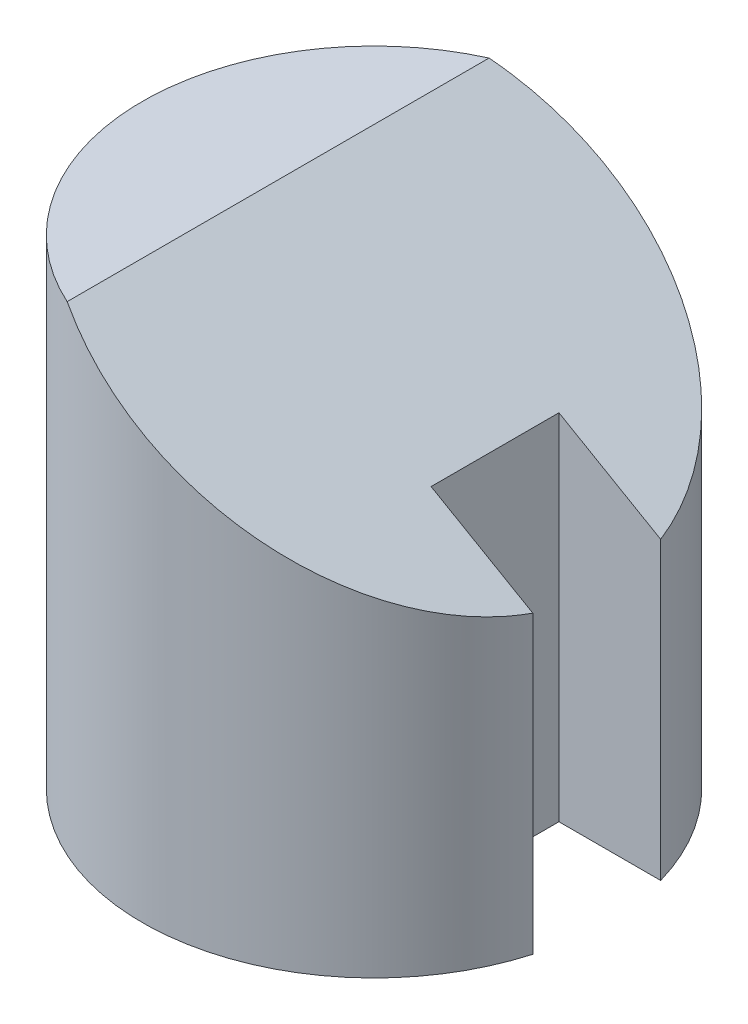
ISO-10303-21;
HEADER;
FILE_DESCRIPTION(('STEP AP214'),'2;1');
FILE_NAME('part.step','',(''),(''),'','','');
FILE_SCHEMA(('AUTOMOTIVE_DESIGN { 1 0 10303 214 1 1 1 1 }'));
ENDSEC;
DATA;
#1=APPLICATION_CONTEXT('core data for automotive mechanical design processes');
#2=APPLICATION_PROTOCOL_DEFINITION('international standard','automotive_design',2000,#1);
#3=PRODUCT_CONTEXT('',#1,'mechanical');
#4=PRODUCT('Part','Part','',(#3));
#5=PRODUCT_RELATED_PRODUCT_CATEGORY('part','',(#4));
#6=PRODUCT_DEFINITION_FORMATION('','',#4);
#7=PRODUCT_DEFINITION_CONTEXT('part definition',#1,'design');
#8=PRODUCT_DEFINITION('design','',#6,#7);
#9=PRODUCT_DEFINITION_SHAPE('','',#8);
#10=(LENGTH_UNIT() NAMED_UNIT(*) SI_UNIT(.MILLI.,.METRE.));
#11=(NAMED_UNIT(*) PLANE_ANGLE_UNIT() SI_UNIT($,.RADIAN.));
#12=(NAMED_UNIT(*) SI_UNIT($,.STERADIAN.) SOLID_ANGLE_UNIT());
#13=UNCERTAINTY_MEASURE_WITH_UNIT(LENGTH_MEASURE(1.E-05),#10,'distance_accuracy_value','');
#14=(GEOMETRIC_REPRESENTATION_CONTEXT(3) GLOBAL_UNCERTAINTY_ASSIGNED_CONTEXT((#13)) GLOBAL_UNIT_ASSIGNED_CONTEXT((#10,
#11,#12)) REPRESENTATION_CONTEXT('',''));
#15=CARTESIAN_POINT('',(0.,0.,0.));
#16=DIRECTION('',(0.,0.,1.));
#17=DIRECTION('',(1.,0.,0.));
#18=AXIS2_PLACEMENT_3D('',#15,#16,#17);
#19=CARTESIAN_POINT('',(0.,60.,0.));
#20=DIRECTION('',(0.,-1.,0.));
#21=DIRECTION('',(0.,0.,-1.));
#22=AXIS2_PLACEMENT_3D('',#19,#20,#21);
#23=CYLINDRICAL_SURFACE('',#22,29.);
#24=CARTESIAN_POINT('',(0.,0.,0.));
#25=DIRECTION('',(0.,1.,0.));
#26=DIRECTION('',(0.,0.,1.));
#27=AXIS2_PLACEMENT_3D('',#24,#25,#26);
#28=CIRCLE('',#27,29.);
#29=CARTESIAN_POINT('',(27.8747197295327,0.,-8.));
#30=VERTEX_POINT('',#29);
#31=CARTESIAN_POINT('',(27.8747197295327,0.,8.));
#32=VERTEX_POINT('',#31);
#33=EDGE_CURVE('E111',#30,#32,#28,.T.);
#34=ORIENTED_EDGE('',*,*,#33,.T.);
#35=DIRECTION('',(0.,1.,0.));
#36=VECTOR('',#35,1.);
#37=CARTESIAN_POINT('',(27.8747197295327,-7.35031913293186,8.));
#38=LINE('',#37,#36);
#39=CARTESIAN_POINT('',(27.8747197295327,36.9783198302937,8.));
#40=VERTEX_POINT('',#39);
#41=EDGE_CURVE('E114',#32,#40,#38,.T.);
#42=ORIENTED_EDGE('',*,*,#41,.T.);
#43=CARTESIAN_POINT('',(0.,53.0717967697246,0.));
#44=DIRECTION('',(0.499999999999995,0.866025403784442,0.));
#45=DIRECTION('',(0.866025403784442,-0.499999999999995,0.));
#46=AXIS2_PLACEMENT_3D('',#43,#44,#45);
#47=ELLIPSE('',#46,33.4863156129982,29.);
#48=CARTESIAN_POINT('',(-12.,60.,26.4007575648882));
#49=VERTEX_POINT('',#48);
#50=EDGE_CURVE('E42',#49,#40,#47,.T.);
#51=ORIENTED_EDGE('',*,*,#50,.F.);
#52=CARTESIAN_POINT('',(0.,60.,0.));
#53=DIRECTION('',(0.,1.,0.));
#54=DIRECTION('',(0.,0.,1.));
#55=AXIS2_PLACEMENT_3D('',#52,#53,#54);
#56=CIRCLE('',#55,29.);
#57=CARTESIAN_POINT('',(-12.,60.,-26.4007575648882));
#58=VERTEX_POINT('',#57);
#59=EDGE_CURVE('E49',#58,#49,#56,.T.);
#60=ORIENTED_EDGE('',*,*,#59,.F.);
#61=CARTESIAN_POINT('',(27.8747197295327,36.9783198302937,-8.));
#62=VERTEX_POINT('',#61);
#63=EDGE_CURVE('E64',#62,#58,#47,.T.);
#64=ORIENTED_EDGE('',*,*,#63,.F.);
#65=DIRECTION('',(0.,1.,0.));
#66=VECTOR('',#65,1.);
#67=CARTESIAN_POINT('',(27.8747197295327,-7.35031913293186,-8.));
#68=LINE('',#67,#66);
#69=EDGE_CURVE('E57',#30,#62,#68,.T.);
#70=ORIENTED_EDGE('',*,*,#69,.F.);
#71=EDGE_LOOP('',(#34,#42,#51,#60,#64,#70));
#72=FACE_BOUND('',#71,.T.);
#73=ADVANCED_FACE('F39',(#72),#23,.T.);
#74=CARTESIAN_POINT('',(0.,60.,0.));
#75=DIRECTION('',(0.,1.,0.));
#76=DIRECTION('',(0.,0.,1.));
#77=AXIS2_PLACEMENT_3D('',#74,#75,#76);
#78=PLANE('',#77);
#79=ORIENTED_EDGE('',*,*,#59,.T.);
#80=DIRECTION('',(0.,0.,-1.));
#81=VECTOR('',#80,1.);
#82=CARTESIAN_POINT('',(-12.,60.,0.));
#83=LINE('',#82,#81);
#84=EDGE_CURVE('E11',#49,#58,#83,.T.);
#85=ORIENTED_EDGE('',*,*,#84,.T.);
#86=EDGE_LOOP('',(#79,#85));
#87=FACE_BOUND('',#86,.T.);
#88=ADVANCED_FACE('F161',(#87),#78,.T.);
#89=CARTESIAN_POINT('',(0.,0.,0.));
#90=DIRECTION('',(0.,1.,0.));
#91=DIRECTION('',(0.,0.,1.));
#92=AXIS2_PLACEMENT_3D('',#89,#90,#91);
#93=PLANE('',#92);
#94=DIRECTION('',(0.,0.,1.));
#95=VECTOR('',#94,1.);
#96=CARTESIAN_POINT('',(15.1435935394489,0.,-8.));
#97=LINE('',#96,#95);
#98=CARTESIAN_POINT('',(15.1435935394489,0.,-8.));
#99=VERTEX_POINT('',#98);
#100=CARTESIAN_POINT('',(15.1435935394489,0.,8.));
#101=VERTEX_POINT('',#100);
#102=EDGE_CURVE('E101',#99,#101,#97,.T.);
#103=ORIENTED_EDGE('',*,*,#102,.T.);
#104=DIRECTION('',(1.,0.,0.));
#105=VECTOR('',#104,1.);
#106=CARTESIAN_POINT('',(0.,0.,8.));
#107=LINE('',#106,#105);
#108=EDGE_CURVE('E113',#101,#32,#107,.T.);
#109=ORIENTED_EDGE('',*,*,#108,.T.);
#110=ORIENTED_EDGE('',*,*,#33,.F.);
#111=DIRECTION('',(-1.,0.,0.));
#112=VECTOR('',#111,1.);
#113=CARTESIAN_POINT('',(0.,0.,-8.));
#114=LINE('',#113,#112);
#115=EDGE_CURVE('E91',#30,#99,#114,.T.);
#116=ORIENTED_EDGE('',*,*,#115,.T.);
#117=EDGE_LOOP('',(#103,#109,#110,#116));
#118=FACE_BOUND('',#117,.T.);
#119=ADVANCED_FACE('F109',(#118),#93,.F.);
#120=CARTESIAN_POINT('',(-12.,60.,29.));
#121=DIRECTION('',(0.499999999999995,0.866025403784442,0.));
#122=DIRECTION('',(-0.866025403784442,0.499999999999995,0.));
#123=AXIS2_PLACEMENT_3D('',#120,#121,#122);
#124=PLANE('',#123);
#125=DIRECTION('',(0.866025403784442,-0.499999999999995,0.));
#126=VECTOR('',#125,1.);
#127=CARTESIAN_POINT('',(27.8747197295327,36.9783198302937,8.));
#128=LINE('',#127,#126);
#129=CARTESIAN_POINT('',(15.1435935394489,44.3286389632256,8.));
#130=VERTEX_POINT('',#129);
#131=EDGE_CURVE('E106',#130,#40,#128,.T.);
#132=ORIENTED_EDGE('',*,*,#131,.F.);
#133=DIRECTION('',(0.,0.,1.));
#134=VECTOR('',#133,1.);
#135=CARTESIAN_POINT('',(15.1435935394489,44.3286389632256,-8.));
#136=LINE('',#135,#134);
#137=CARTESIAN_POINT('',(15.1435935394489,44.3286389632256,-8.));
#138=VERTEX_POINT('',#137);
#139=EDGE_CURVE('E141',#138,#130,#136,.T.);
#140=ORIENTED_EDGE('',*,*,#139,.F.);
#141=DIRECTION('',(-0.866025403784442,0.499999999999995,0.));
#142=VECTOR('',#141,1.);
#143=CARTESIAN_POINT('',(27.8747197295327,36.9783198302937,-8.));
#144=LINE('',#143,#142);
#145=EDGE_CURVE('E92',#62,#138,#144,.T.);
#146=ORIENTED_EDGE('',*,*,#145,.F.);
#147=ORIENTED_EDGE('',*,*,#63,.T.);
#148=ORIENTED_EDGE('',*,*,#84,.F.);
#149=ORIENTED_EDGE('',*,*,#50,.T.);
#150=EDGE_LOOP('',(#132,#140,#146,#147,#148,#149));
#151=FACE_BOUND('',#150,.T.);
#152=ADVANCED_FACE('F159',(#151),#124,.T.);
#153=CARTESIAN_POINT('',(27.8747197295327,-7.35031913293186,8.));
#154=DIRECTION('',(0.,0.,1.));
#155=DIRECTION('',(1.,0.,0.));
#156=AXIS2_PLACEMENT_3D('',#153,#154,#155);
#157=PLANE('',#156);
#158=DIRECTION('',(0.,1.,0.));
#159=VECTOR('',#158,1.);
#160=CARTESIAN_POINT('',(15.1435935394489,0.,8.));
#161=LINE('',#160,#159);
#162=EDGE_CURVE('E97',#101,#130,#161,.T.);
#163=ORIENTED_EDGE('',*,*,#162,.T.);
#164=ORIENTED_EDGE('',*,*,#131,.T.);
#165=ORIENTED_EDGE('',*,*,#41,.F.);
#166=ORIENTED_EDGE('',*,*,#108,.F.);
#167=EDGE_LOOP('',(#163,#164,#165,#166));
#168=FACE_BOUND('',#167,.T.);
#169=ADVANCED_FACE('F153',(#168),#157,.F.);
#170=CARTESIAN_POINT('',(27.8747197295327,-7.35031913293186,-8.));
#171=DIRECTION('',(0.,0.,-1.));
#172=DIRECTION('',(-1.,0.,0.));
#173=AXIS2_PLACEMENT_3D('',#170,#171,#172);
#174=PLANE('',#173);
#175=ORIENTED_EDGE('',*,*,#69,.T.);
#176=ORIENTED_EDGE('',*,*,#145,.T.);
#177=DIRECTION('',(0.,1.,0.));
#178=VECTOR('',#177,1.);
#179=CARTESIAN_POINT('',(15.1435935394489,0.,-8.));
#180=LINE('',#179,#178);
#181=EDGE_CURVE('E87',#99,#138,#180,.T.);
#182=ORIENTED_EDGE('',*,*,#181,.F.);
#183=ORIENTED_EDGE('',*,*,#115,.F.);
#184=EDGE_LOOP('',(#175,#176,#182,#183));
#185=FACE_BOUND('',#184,.T.);
#186=ADVANCED_FACE('F89',(#185),#174,.F.);
#187=CARTESIAN_POINT('',(15.1435935394489,0.,-8.));
#188=DIRECTION('',(-1.,0.,0.));
#189=DIRECTION('',(0.,0.,1.));
#190=AXIS2_PLACEMENT_3D('',#187,#188,#189);
#191=PLANE('',#190);
#192=ORIENTED_EDGE('',*,*,#139,.T.);
#193=ORIENTED_EDGE('',*,*,#162,.F.);
#194=ORIENTED_EDGE('',*,*,#102,.F.);
#195=ORIENTED_EDGE('',*,*,#181,.T.);
#196=EDGE_LOOP('',(#192,#193,#194,#195));
#197=FACE_BOUND('',#196,.T.);
#198=ADVANCED_FACE('F102',(#197),#191,.F.);
#199=CLOSED_SHELL('',(#73,#88,#119,#152,#169,#186,#198));
#200=MANIFOLD_SOLID_BREP('B2',#199);
#201=ADVANCED_BREP_SHAPE_REPRESENTATION('',(#18,#200),#14);
#202=SHAPE_DEFINITION_REPRESENTATION(#9,#201);
ENDSEC;
END-ISO-10303-21;
